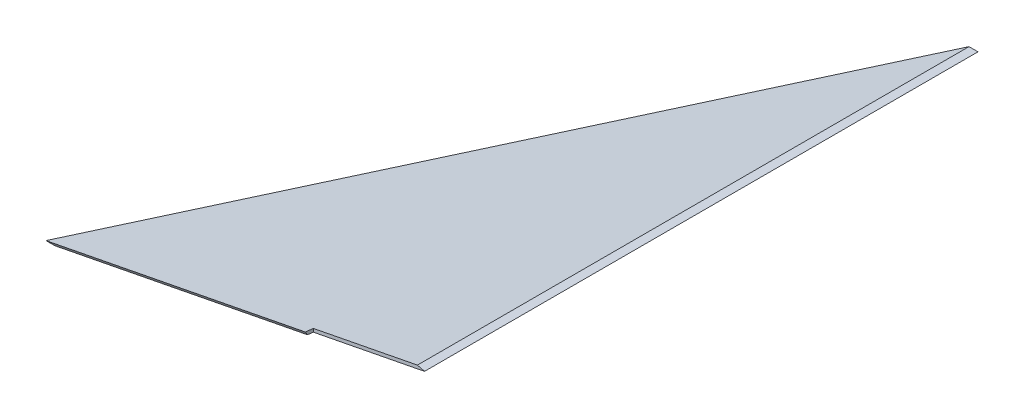
ISO-10303-21;
HEADER;
FILE_DESCRIPTION(('STEP AP214'),'2;1');
FILE_NAME('part.step','',(''),(''),'','','');
FILE_SCHEMA(('AUTOMOTIVE_DESIGN { 1 0 10303 214 1 1 1 1 }'));
ENDSEC;
DATA;
#1=APPLICATION_CONTEXT('core data for automotive mechanical design processes');
#2=APPLICATION_PROTOCOL_DEFINITION('international standard','automotive_design',2000,#1);
#3=PRODUCT_CONTEXT('',#1,'mechanical');
#4=PRODUCT('Part','Part','',(#3));
#5=PRODUCT_RELATED_PRODUCT_CATEGORY('part','',(#4));
#6=PRODUCT_DEFINITION_FORMATION('','',#4);
#7=PRODUCT_DEFINITION_CONTEXT('part definition',#1,'design');
#8=PRODUCT_DEFINITION('design','',#6,#7);
#9=PRODUCT_DEFINITION_SHAPE('','',#8);
#10=(LENGTH_UNIT() NAMED_UNIT(*) SI_UNIT(.MILLI.,.METRE.));
#11=(NAMED_UNIT(*) PLANE_ANGLE_UNIT() SI_UNIT($,.RADIAN.));
#12=(NAMED_UNIT(*) SI_UNIT($,.STERADIAN.) SOLID_ANGLE_UNIT());
#13=UNCERTAINTY_MEASURE_WITH_UNIT(LENGTH_MEASURE(1.E-05),#10,'distance_accuracy_value','');
#14=(GEOMETRIC_REPRESENTATION_CONTEXT(3) GLOBAL_UNCERTAINTY_ASSIGNED_CONTEXT((#13)) GLOBAL_UNIT_ASSIGNED_CONTEXT((#10,
#11,#12)) REPRESENTATION_CONTEXT('',''));
#15=CARTESIAN_POINT('',(0.,0.,0.));
#16=DIRECTION('',(0.,0.,1.));
#17=DIRECTION('',(1.,0.,0.));
#18=AXIS2_PLACEMENT_3D('',#15,#16,#17);
#19=CARTESIAN_POINT('',(304.8,0.,0.));
#20=DIRECTION('',(0.,-1.,0.));
#21=DIRECTION('',(0.,0.,-1.));
#22=AXIS2_PLACEMENT_3D('',#19,#20,#21);
#23=PLANE('',#22);
#24=DIRECTION('',(0.978626263746878,0.,0.205646871857625));
#25=VECTOR('',#24,1.);
#26=CARTESIAN_POINT('',(-26.4371472708504,0.,125.808316091043));
#27=LINE('',#26,#25);
#28=CARTESIAN_POINT('',(301.625,0.,194.746742189319));
#29=VERTEX_POINT('',#28);
#30=CARTESIAN_POINT('',(304.8,0.,195.413931332238));
#31=VERTEX_POINT('',#30);
#32=EDGE_CURVE('E82',#29,#31,#27,.T.);
#33=ORIENTED_EDGE('',*,*,#32,.T.);
#34=DIRECTION('',(0.,0.,1.));
#35=VECTOR('',#34,1.);
#36=CARTESIAN_POINT('',(304.8,0.,0.));
#37=LINE('',#36,#35);
#38=CARTESIAN_POINT('',(304.8,0.,0.));
#39=VERTEX_POINT('',#38);
#40=EDGE_CURVE('E94',#39,#31,#37,.T.);
#41=ORIENTED_EDGE('',*,*,#40,.F.);
#42=DIRECTION('',(-1.,0.,0.));
#43=VECTOR('',#42,1.);
#44=CARTESIAN_POINT('',(304.8,0.,0.));
#45=LINE('',#44,#43);
#46=CARTESIAN_POINT('',(301.625,0.,0.));
#47=VERTEX_POINT('',#46);
#48=EDGE_CURVE('E104',#39,#47,#45,.T.);
#49=ORIENTED_EDGE('',*,*,#48,.T.);
#50=DIRECTION('',(0.,0.,-1.));
#51=VECTOR('',#50,1.);
#52=CARTESIAN_POINT('',(301.625,0.,197.18));
#53=LINE('',#52,#51);
#54=EDGE_CURVE('E87',#29,#47,#53,.T.);
#55=ORIENTED_EDGE('',*,*,#54,.F.);
#56=EDGE_LOOP('',(#33,#41,#49,#55));
#57=FACE_BOUND('',#56,.T.);
#58=ADVANCED_FACE('F32',(#57),#23,.F.);
#59=CARTESIAN_POINT('',(304.8,0.,197.18));
#60=DIRECTION('',(0.,0.500000000000004,-0.866025403784436));
#61=DIRECTION('',(0.,0.866025403784436,0.500000000000004));
#62=AXIS2_PLACEMENT_3D('',#59,#60,#61);
#63=PLANE('',#62);
#64=DIRECTION('',(0.10449395752387,-0.861284366298812,-0.497262760731441));
#65=VECTOR('',#64,1.);
#66=CARTESIAN_POINT('',(253.090232752505,-4.70520402473057,194.46344918973));
#67=LINE('',#66,#65);
#68=CARTESIAN_POINT('',(254.596089188048,-17.1171236855106,187.297424032418));
#69=VERTEX_POINT('',#68);
#70=CARTESIAN_POINT('',(254.730361957046,-18.2238578881182,186.658450742621));
#71=VERTEX_POINT('',#70);
#72=EDGE_CURVE('E124',#69,#71,#67,.T.);
#73=ORIENTED_EDGE('',*,*,#72,.F.);
#74=DIRECTION('',(-0.921891033043757,-0.335540895264848,-0.19372462620529));
#75=VECTOR('',#74,1.);
#76=CARTESIAN_POINT('',(304.323378768861,0.98212955264113,197.747032761596));
#77=LINE('',#76,#75);
#78=CARTESIAN_POINT('',(138.684947672369,-59.3053290170354,162.940052327635));
#79=VERTEX_POINT('',#78);
#80=EDGE_CURVE('E54',#69,#79,#77,.T.);
#81=ORIENTED_EDGE('',*,*,#80,.T.);
#82=DIRECTION('',(-1.,0.,0.));
#83=VECTOR('',#82,1.);
#84=CARTESIAN_POINT('',(304.8,-59.3053290170354,162.940052327635));
#85=LINE('',#84,#83);
#86=CARTESIAN_POINT('',(141.859947672369,-59.3053290170354,162.940052327635));
#87=VERTEX_POINT('',#86);
#88=EDGE_CURVE('E100',#87,#79,#85,.T.);
#89=ORIENTED_EDGE('',*,*,#88,.F.);
#90=DIRECTION('',(0.921891033043757,0.335540895264848,0.19372462620529));
#91=VECTOR('',#90,1.);
#92=CARTESIAN_POINT('',(304.8,0.,197.18));
#93=LINE('',#92,#91);
#94=EDGE_CURVE('E116',#87,#71,#93,.T.);
#95=ORIENTED_EDGE('',*,*,#94,.T.);
#96=EDGE_LOOP('',(#73,#81,#89,#95));
#97=FACE_BOUND('',#96,.T.);
#98=ADVANCED_FACE('F123',(#97),#63,.F.);
#99=CARTESIAN_POINT('',(304.8,0.,-1.2E-05));
#100=DIRECTION('',(-0.342020143325669,0.939692620785908,0.));
#101=DIRECTION('',(-0.939692620785908,-0.342020143325669,0.));
#102=AXIS2_PLACEMENT_3D('',#99,#100,#101);
#103=PLANE('',#102);
#104=DIRECTION('',(0.921891033043757,0.335540895264848,0.19372462620529));
#105=VECTOR('',#104,1.);
#106=CARTESIAN_POINT('',(269.900438443423,-12.7024015955351,188.080196351701));
#107=LINE('',#106,#105);
#108=CARTESIAN_POINT('',(255.085785801659,-18.0944941881305,184.967070241871));
#109=VERTEX_POINT('',#108);
#110=EDGE_CURVE('E79',#109,#31,#107,.T.);
#111=ORIENTED_EDGE('',*,*,#110,.F.);
#112=DIRECTION('',(0.205073220657116,0.0746405481642951,-0.975896389346252));
#113=VECTOR('',#112,1.);
#114=CARTESIAN_POINT('',(294.470988808593,-3.75945262307456,-2.45807130014363));
#115=LINE('',#114,#113);
#116=EDGE_CURVE('E88',#71,#109,#115,.T.);
#117=ORIENTED_EDGE('',*,*,#116,.F.);
#118=ORIENTED_EDGE('',*,*,#94,.F.);
#119=DIRECTION('',(-0.684791078771729,-0.249243569363952,0.684791078771743));
#120=VECTOR('',#119,1.);
#121=CARTESIAN_POINT('',(218.268863796684,-31.4947579152416,86.5311362033176));
#122=LINE('',#121,#120);
#123=EDGE_CURVE('E99',#39,#87,#122,.T.);
#124=ORIENTED_EDGE('',*,*,#123,.F.);
#125=ORIENTED_EDGE('',*,*,#40,.T.);
#126=EDGE_LOOP('',(#111,#117,#118,#124,#125));
#127=FACE_BOUND('',#126,.T.);
#128=ADVANCED_FACE('F97',(#127),#103,.F.);
#129=CARTESIAN_POINT('',(138.684947672369,-59.3053290170354,-1.2E-05));
#130=DIRECTION('',(0.34202014332567,-0.939692620785908,0.));
#131=DIRECTION('',(0.939692620785908,0.34202014332567,0.));
#132=AXIS2_PLACEMENT_3D('',#129,#130,#131);
#133=PLANE('',#132);
#134=DIRECTION('',(-0.921891033043757,-0.335540895264848,-0.19372462620529));
#135=VECTOR('',#134,1.);
#136=CARTESIAN_POINT('',(110.01955625368,-69.7386782470279,154.483097530468));
#137=LINE('',#136,#135);
#138=CARTESIAN_POINT('',(255.085785801659,-16.9388886943353,184.967070241871));
#139=VERTEX_POINT('',#138);
#140=EDGE_CURVE('E11',#29,#139,#137,.T.);
#141=ORIENTED_EDGE('',*,*,#140,.F.);
#142=ORIENTED_EDGE('',*,*,#54,.T.);
#143=DIRECTION('',(0.684791078771729,0.249243569363952,-0.684791078771744));
#144=VECTOR('',#143,1.);
#145=CARTESIAN_POINT('',(216.582744555154,-30.9528496367868,85.0422554448476));
#146=LINE('',#145,#144);
#147=EDGE_CURVE('E101',#79,#47,#146,.T.);
#148=ORIENTED_EDGE('',*,*,#147,.F.);
#149=ORIENTED_EDGE('',*,*,#80,.F.);
#150=DIRECTION('',(-0.205073220657116,-0.0746405481642952,0.975896389346252));
#151=VECTOR('',#150,1.);
#152=CARTESIAN_POINT('',(286.559553913823,-5.48337394131079,35.1906315564023));
#153=LINE('',#152,#151);
#154=EDGE_CURVE('E40',#139,#69,#153,.T.);
#155=ORIENTED_EDGE('',*,*,#154,.F.);
#156=EDGE_LOOP('',(#141,#142,#148,#149,#155));
#157=FACE_BOUND('',#156,.T.);
#158=ADVANCED_FACE('F130',(#157),#133,.F.);
#159=CARTESIAN_POINT('',(304.8,-59.3053290170354,162.940052327635));
#160=DIRECTION('',(0.,0.939692620785911,0.342020143325663));
#161=DIRECTION('',(0.,-0.342020143325663,0.939692620785911));
#162=AXIS2_PLACEMENT_3D('',#159,#160,#161);
#163=PLANE('',#162);
#164=ORIENTED_EDGE('',*,*,#48,.F.);
#165=ORIENTED_EDGE('',*,*,#123,.T.);
#166=ORIENTED_EDGE('',*,*,#88,.T.);
#167=ORIENTED_EDGE('',*,*,#147,.T.);
#168=EDGE_LOOP('',(#164,#165,#166,#167));
#169=FACE_BOUND('',#168,.T.);
#170=ADVANCED_FACE('F34',(#169),#163,.F.);
#171=CARTESIAN_POINT('',(-26.4371472708504,-59.3053540170355,125.808316091043));
#172=DIRECTION('',(-0.205646871857625,0.,0.978626263746878));
#173=DIRECTION('',(0.978626263746878,0.,0.205646871857625));
#174=AXIS2_PLACEMENT_3D('',#171,#172,#173);
#175=PLANE('',#174);
#176=ORIENTED_EDGE('',*,*,#110,.T.);
#177=ORIENTED_EDGE('',*,*,#32,.F.);
#178=ORIENTED_EDGE('',*,*,#140,.T.);
#179=DIRECTION('',(0.,1.,0.));
#180=VECTOR('',#179,1.);
#181=CARTESIAN_POINT('',(255.085785801659,-59.3053540170355,184.967070241871));
#182=LINE('',#181,#180);
#183=EDGE_CURVE('E47',#109,#139,#182,.T.);
#184=ORIENTED_EDGE('',*,*,#183,.F.);
#185=EDGE_LOOP('',(#176,#177,#178,#184));
#186=FACE_BOUND('',#185,.T.);
#187=ADVANCED_FACE('F81',(#186),#175,.T.);
#188=CARTESIAN_POINT('',(281.522933072509,-59.3053540170355,59.1587541508295));
#189=DIRECTION('',(0.978626263746877,0.,0.205646871857629));
#190=DIRECTION('',(0.205646871857629,0.,-0.978626263746877));
#191=AXIS2_PLACEMENT_3D('',#188,#189,#190);
#192=PLANE('',#191);
#193=ORIENTED_EDGE('',*,*,#116,.T.);
#194=ORIENTED_EDGE('',*,*,#183,.T.);
#195=ORIENTED_EDGE('',*,*,#154,.T.);
#196=ORIENTED_EDGE('',*,*,#72,.T.);
#197=EDGE_LOOP('',(#193,#194,#195,#196));
#198=FACE_BOUND('',#197,.T.);
#199=ADVANCED_FACE('F127',(#198),#192,.T.);
#200=CLOSED_SHELL('',(#58,#98,#128,#158,#170,#187,#199));
#201=MANIFOLD_SOLID_BREP('B2',#200);
#202=ADVANCED_BREP_SHAPE_REPRESENTATION('',(#18,#201),#14);
#203=SHAPE_DEFINITION_REPRESENTATION(#9,#202);
ENDSEC;
END-ISO-10303-21;
